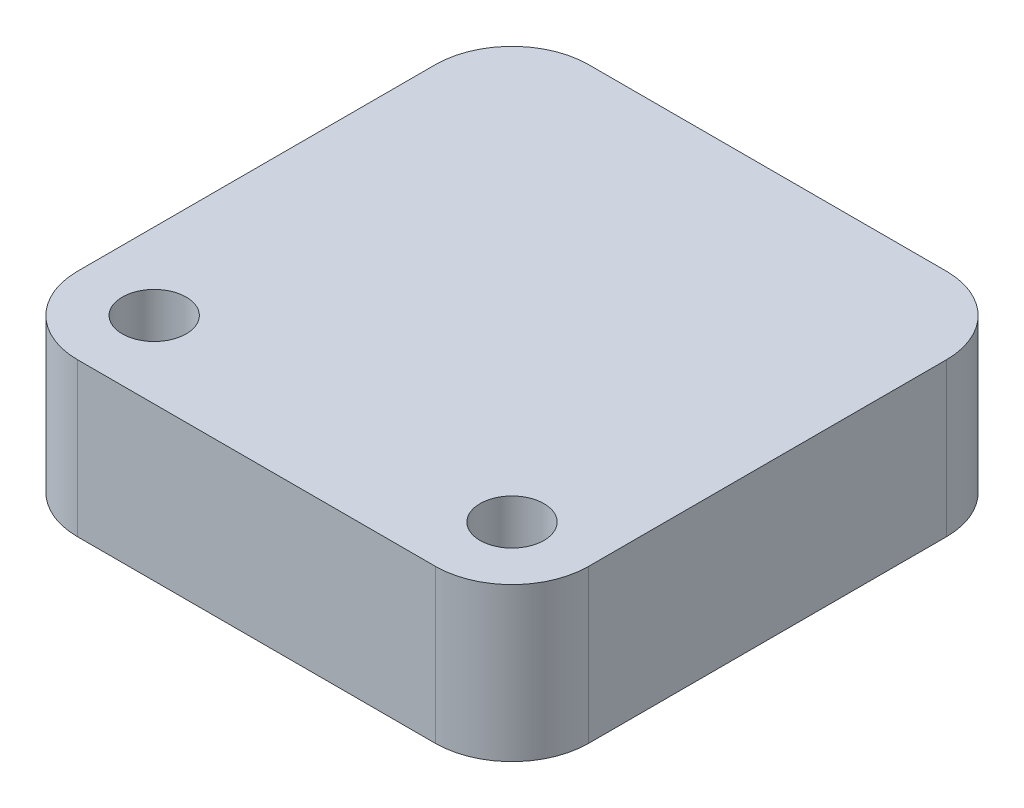
ISO-10303-21;
HEADER;
FILE_DESCRIPTION(('STEP AP214'),'2;1');
FILE_NAME('part.step','',(''),(''),'','','');
FILE_SCHEMA(('AUTOMOTIVE_DESIGN { 1 0 10303 214 1 1 1 1 }'));
ENDSEC;
DATA;
#1=APPLICATION_CONTEXT('core data for automotive mechanical design processes');
#2=APPLICATION_PROTOCOL_DEFINITION('international standard','automotive_design',2000,#1);
#3=PRODUCT_CONTEXT('',#1,'mechanical');
#4=PRODUCT('Part','Part','',(#3));
#5=PRODUCT_RELATED_PRODUCT_CATEGORY('part','',(#4));
#6=PRODUCT_DEFINITION_FORMATION('','',#4);
#7=PRODUCT_DEFINITION_CONTEXT('part definition',#1,'design');
#8=PRODUCT_DEFINITION('design','',#6,#7);
#9=PRODUCT_DEFINITION_SHAPE('','',#8);
#10=(LENGTH_UNIT() NAMED_UNIT(*) SI_UNIT(.MILLI.,.METRE.));
#11=(NAMED_UNIT(*) PLANE_ANGLE_UNIT() SI_UNIT($,.RADIAN.));
#12=(NAMED_UNIT(*) SI_UNIT($,.STERADIAN.) SOLID_ANGLE_UNIT());
#13=UNCERTAINTY_MEASURE_WITH_UNIT(LENGTH_MEASURE(1.E-05),#10,'distance_accuracy_value','');
#14=(GEOMETRIC_REPRESENTATION_CONTEXT(3) GLOBAL_UNCERTAINTY_ASSIGNED_CONTEXT((#13)) GLOBAL_UNIT_ASSIGNED_CONTEXT((#10,
#11,#12)) REPRESENTATION_CONTEXT('',''));
#15=CARTESIAN_POINT('',(0.,0.,0.));
#16=DIRECTION('',(0.,0.,1.));
#17=DIRECTION('',(1.,0.,0.));
#18=AXIS2_PLACEMENT_3D('',#15,#16,#17);
#19=CARTESIAN_POINT('',(0.,6.,0.));
#20=DIRECTION('',(1.,0.,0.));
#21=DIRECTION('',(0.,0.,-1.));
#22=AXIS2_PLACEMENT_3D('',#19,#20,#21);
#23=PLANE('',#22);
#24=DIRECTION('',(0.,0.,1.));
#25=VECTOR('',#24,1.);
#26=CARTESIAN_POINT('',(0.,6.,0.));
#27=LINE('',#26,#25);
#28=CARTESIAN_POINT('',(0.,6.,-17.));
#29=VERTEX_POINT('',#28);
#30=CARTESIAN_POINT('',(0.,6.,-3.));
#31=VERTEX_POINT('',#30);
#32=EDGE_CURVE('E139',#29,#31,#27,.T.);
#33=ORIENTED_EDGE('',*,*,#32,.F.);
#34=DIRECTION('',(0.,-1.,0.));
#35=VECTOR('',#34,1.);
#36=CARTESIAN_POINT('',(0.,6.,-17.));
#37=LINE('',#36,#35);
#38=CARTESIAN_POINT('',(0.,0.,-17.));
#39=VERTEX_POINT('',#38);
#40=EDGE_CURVE('E178',#29,#39,#37,.T.);
#41=ORIENTED_EDGE('',*,*,#40,.T.);
#42=DIRECTION('',(0.,0.,1.));
#43=VECTOR('',#42,1.);
#44=CARTESIAN_POINT('',(0.,0.,0.));
#45=LINE('',#44,#43);
#46=CARTESIAN_POINT('',(0.,0.,-3.));
#47=VERTEX_POINT('',#46);
#48=EDGE_CURVE('E193',#39,#47,#45,.T.);
#49=ORIENTED_EDGE('',*,*,#48,.T.);
#50=DIRECTION('',(0.,-1.,0.));
#51=VECTOR('',#50,1.);
#52=CARTESIAN_POINT('',(0.,6.,-3.));
#53=LINE('',#52,#51);
#54=EDGE_CURVE('E175',#47,#31,#53,.F.);
#55=ORIENTED_EDGE('',*,*,#54,.T.);
#56=EDGE_LOOP('',(#33,#41,#49,#55));
#57=FACE_BOUND('',#56,.T.);
#58=ADVANCED_FACE('F43',(#57),#23,.F.);
#59=CARTESIAN_POINT('',(0.,6.,0.));
#60=DIRECTION('',(0.,0.,-1.));
#61=DIRECTION('',(-1.,0.,0.));
#62=AXIS2_PLACEMENT_3D('',#59,#60,#61);
#63=PLANE('',#62);
#64=DIRECTION('',(1.,0.,0.));
#65=VECTOR('',#64,1.);
#66=CARTESIAN_POINT('',(0.,6.,0.));
#67=LINE('',#66,#65);
#68=CARTESIAN_POINT('',(3.,6.,0.));
#69=VERTEX_POINT('',#68);
#70=CARTESIAN_POINT('',(17.,6.,0.));
#71=VERTEX_POINT('',#70);
#72=EDGE_CURVE('E144',#69,#71,#67,.T.);
#73=ORIENTED_EDGE('',*,*,#72,.F.);
#74=DIRECTION('',(0.,-1.,0.));
#75=VECTOR('',#74,1.);
#76=CARTESIAN_POINT('',(3.,6.,0.));
#77=LINE('',#76,#75);
#78=CARTESIAN_POINT('',(3.,0.,0.));
#79=VERTEX_POINT('',#78);
#80=EDGE_CURVE('E11',#69,#79,#77,.T.);
#81=ORIENTED_EDGE('',*,*,#80,.T.);
#82=DIRECTION('',(1.,0.,0.));
#83=VECTOR('',#82,1.);
#84=CARTESIAN_POINT('',(0.,0.,0.));
#85=LINE('',#84,#83);
#86=CARTESIAN_POINT('',(17.,0.,0.));
#87=VERTEX_POINT('',#86);
#88=EDGE_CURVE('E146',#79,#87,#85,.T.);
#89=ORIENTED_EDGE('',*,*,#88,.T.);
#90=DIRECTION('',(0.,-1.,0.));
#91=VECTOR('',#90,1.);
#92=CARTESIAN_POINT('',(17.,6.,0.));
#93=LINE('',#92,#91);
#94=EDGE_CURVE('E52',#87,#71,#93,.F.);
#95=ORIENTED_EDGE('',*,*,#94,.T.);
#96=EDGE_LOOP('',(#73,#81,#89,#95));
#97=FACE_BOUND('',#96,.T.);
#98=ADVANCED_FACE('F199',(#97),#63,.F.);
#99=CARTESIAN_POINT('',(20.,6.,0.));
#100=DIRECTION('',(-1.,0.,0.));
#101=DIRECTION('',(0.,0.,1.));
#102=AXIS2_PLACEMENT_3D('',#99,#100,#101);
#103=PLANE('',#102);
#104=DIRECTION('',(0.,0.,-1.));
#105=VECTOR('',#104,1.);
#106=CARTESIAN_POINT('',(20.,0.,0.));
#107=LINE('',#106,#105);
#108=CARTESIAN_POINT('',(20.,0.,-3.));
#109=VERTEX_POINT('',#108);
#110=CARTESIAN_POINT('',(20.,0.,-17.));
#111=VERTEX_POINT('',#110);
#112=EDGE_CURVE('E140',#109,#111,#107,.T.);
#113=ORIENTED_EDGE('',*,*,#112,.T.);
#114=DIRECTION('',(0.,-1.,0.));
#115=VECTOR('',#114,1.);
#116=CARTESIAN_POINT('',(20.,6.,-17.));
#117=LINE('',#116,#115);
#118=CARTESIAN_POINT('',(20.,6.,-17.));
#119=VERTEX_POINT('',#118);
#120=EDGE_CURVE('E115',#111,#119,#117,.F.);
#121=ORIENTED_EDGE('',*,*,#120,.T.);
#122=DIRECTION('',(0.,0.,-1.));
#123=VECTOR('',#122,1.);
#124=CARTESIAN_POINT('',(20.,6.,0.));
#125=LINE('',#124,#123);
#126=CARTESIAN_POINT('',(20.,6.,-3.));
#127=VERTEX_POINT('',#126);
#128=EDGE_CURVE('E184',#127,#119,#125,.T.);
#129=ORIENTED_EDGE('',*,*,#128,.F.);
#130=DIRECTION('',(0.,-1.,0.));
#131=VECTOR('',#130,1.);
#132=CARTESIAN_POINT('',(20.,6.,-3.));
#133=LINE('',#132,#131);
#134=EDGE_CURVE('E121',#127,#109,#133,.T.);
#135=ORIENTED_EDGE('',*,*,#134,.T.);
#136=EDGE_LOOP('',(#113,#121,#129,#135));
#137=FACE_BOUND('',#136,.T.);
#138=ADVANCED_FACE('F206',(#137),#103,.F.);
#139=CARTESIAN_POINT('',(0.,6.,-20.));
#140=DIRECTION('',(0.,0.,1.));
#141=DIRECTION('',(1.,0.,0.));
#142=AXIS2_PLACEMENT_3D('',#139,#140,#141);
#143=PLANE('',#142);
#144=DIRECTION('',(-1.,0.,0.));
#145=VECTOR('',#144,1.);
#146=CARTESIAN_POINT('',(0.,6.,-20.));
#147=LINE('',#146,#145);
#148=CARTESIAN_POINT('',(17.,6.,-20.));
#149=VERTEX_POINT('',#148);
#150=CARTESIAN_POINT('',(3.,6.,-20.));
#151=VERTEX_POINT('',#150);
#152=EDGE_CURVE('E131',#149,#151,#147,.T.);
#153=ORIENTED_EDGE('',*,*,#152,.F.);
#154=DIRECTION('',(0.,-1.,0.));
#155=VECTOR('',#154,1.);
#156=CARTESIAN_POINT('',(17.,6.,-20.));
#157=LINE('',#156,#155);
#158=CARTESIAN_POINT('',(17.,0.,-20.));
#159=VERTEX_POINT('',#158);
#160=EDGE_CURVE('E114',#149,#159,#157,.T.);
#161=ORIENTED_EDGE('',*,*,#160,.T.);
#162=DIRECTION('',(-1.,0.,0.));
#163=VECTOR('',#162,1.);
#164=CARTESIAN_POINT('',(0.,0.,-20.));
#165=LINE('',#164,#163);
#166=CARTESIAN_POINT('',(3.,0.,-20.));
#167=VERTEX_POINT('',#166);
#168=EDGE_CURVE('E128',#159,#167,#165,.T.);
#169=ORIENTED_EDGE('',*,*,#168,.T.);
#170=DIRECTION('',(0.,-1.,0.));
#171=VECTOR('',#170,1.);
#172=CARTESIAN_POINT('',(3.,6.,-20.));
#173=LINE('',#172,#171);
#174=EDGE_CURVE('E134',#167,#151,#173,.F.);
#175=ORIENTED_EDGE('',*,*,#174,.T.);
#176=EDGE_LOOP('',(#153,#161,#169,#175));
#177=FACE_BOUND('',#176,.T.);
#178=ADVANCED_FACE('F127',(#177),#143,.F.);
#179=CARTESIAN_POINT('',(0.,6.,0.));
#180=DIRECTION('',(0.,-1.,0.));
#181=DIRECTION('',(0.,0.,-1.));
#182=AXIS2_PLACEMENT_3D('',#179,#180,#181);
#183=PLANE('',#182);
#184=CARTESIAN_POINT('',(3.,6.,-3.));
#185=DIRECTION('',(0.,1.,0.));
#186=DIRECTION('',(0.,0.,1.));
#187=AXIS2_PLACEMENT_3D('',#184,#185,#186);
#188=CIRCLE('',#187,1.25);
#189=CARTESIAN_POINT('',(3.,6.,-1.75));
#190=VERTEX_POINT('',#189);
#191=EDGE_CURVE('E267',#190,#190,#188,.T.);
#192=ORIENTED_EDGE('',*,*,#191,.F.);
#193=EDGE_LOOP('',(#192));
#194=FACE_BOUND('',#193,.T.);
#195=CARTESIAN_POINT('',(17.,6.,-3.));
#196=DIRECTION('',(0.,1.,0.));
#197=DIRECTION('',(0.,0.,1.));
#198=AXIS2_PLACEMENT_3D('',#195,#196,#197);
#199=CIRCLE('',#198,1.25);
#200=CARTESIAN_POINT('',(17.,6.,-1.75));
#201=VERTEX_POINT('',#200);
#202=EDGE_CURVE('E264',#201,#201,#199,.T.);
#203=ORIENTED_EDGE('',*,*,#202,.F.);
#204=EDGE_LOOP('',(#203));
#205=FACE_BOUND('',#204,.T.);
#206=ORIENTED_EDGE('',*,*,#128,.T.);
#207=CARTESIAN_POINT('',(17.,6.,-17.));
#208=DIRECTION('',(0.,-1.,0.));
#209=DIRECTION('',(0.,0.,-1.));
#210=AXIS2_PLACEMENT_3D('',#207,#208,#209);
#211=CIRCLE('',#210,3.);
#212=EDGE_CURVE('E172',#119,#149,#211,.F.);
#213=ORIENTED_EDGE('',*,*,#212,.T.);
#214=ORIENTED_EDGE('',*,*,#152,.T.);
#215=CARTESIAN_POINT('',(3.,6.,-17.));
#216=DIRECTION('',(0.,-1.,0.));
#217=DIRECTION('',(0.,0.,-1.));
#218=AXIS2_PLACEMENT_3D('',#215,#216,#217);
#219=CIRCLE('',#218,3.);
#220=EDGE_CURVE('E169',#151,#29,#219,.F.);
#221=ORIENTED_EDGE('',*,*,#220,.T.);
#222=ORIENTED_EDGE('',*,*,#32,.T.);
#223=CARTESIAN_POINT('',(3.,6.,-3.));
#224=DIRECTION('',(0.,-1.,0.));
#225=DIRECTION('',(0.,0.,-1.));
#226=AXIS2_PLACEMENT_3D('',#223,#224,#225);
#227=CIRCLE('',#226,3.);
#228=EDGE_CURVE('E65',#31,#69,#227,.F.);
#229=ORIENTED_EDGE('',*,*,#228,.T.);
#230=ORIENTED_EDGE('',*,*,#72,.T.);
#231=CARTESIAN_POINT('',(17.,6.,-3.));
#232=DIRECTION('',(0.,-1.,0.));
#233=DIRECTION('',(0.,0.,-1.));
#234=AXIS2_PLACEMENT_3D('',#231,#232,#233);
#235=CIRCLE('',#234,3.);
#236=EDGE_CURVE('E164',#71,#127,#235,.F.);
#237=ORIENTED_EDGE('',*,*,#236,.T.);
#238=EDGE_LOOP('',(#206,#213,#214,#221,#222,#229,#230,#237));
#239=FACE_BOUND('',#238,.T.);
#240=ADVANCED_FACE('F204',(#194,#205,#239),#183,.F.);
#241=CARTESIAN_POINT('',(0.,0.,0.));
#242=DIRECTION('',(0.,-1.,0.));
#243=DIRECTION('',(0.,0.,-1.));
#244=AXIS2_PLACEMENT_3D('',#241,#242,#243);
#245=PLANE('',#244);
#246=CARTESIAN_POINT('',(3.,0.,-3.));
#247=DIRECTION('',(0.,1.,0.));
#248=DIRECTION('',(0.,0.,1.));
#249=AXIS2_PLACEMENT_3D('',#246,#247,#248);
#250=CIRCLE('',#249,1.25);
#251=CARTESIAN_POINT('',(3.,0.,-1.75));
#252=VERTEX_POINT('',#251);
#253=EDGE_CURVE('E196',#252,#252,#250,.T.);
#254=ORIENTED_EDGE('',*,*,#253,.T.);
#255=EDGE_LOOP('',(#254));
#256=FACE_BOUND('',#255,.T.);
#257=CARTESIAN_POINT('',(17.,0.,-3.));
#258=DIRECTION('',(0.,1.,0.));
#259=DIRECTION('',(0.,0.,1.));
#260=AXIS2_PLACEMENT_3D('',#257,#258,#259);
#261=CIRCLE('',#260,1.25);
#262=CARTESIAN_POINT('',(17.,0.,-1.75));
#263=VERTEX_POINT('',#262);
#264=EDGE_CURVE('E262',#263,#263,#261,.T.);
#265=ORIENTED_EDGE('',*,*,#264,.T.);
#266=EDGE_LOOP('',(#265));
#267=FACE_BOUND('',#266,.T.);
#268=ORIENTED_EDGE('',*,*,#168,.F.);
#269=CARTESIAN_POINT('',(17.,0.,-17.));
#270=DIRECTION('',(0.,-1.,0.));
#271=DIRECTION('',(0.,0.,-1.));
#272=AXIS2_PLACEMENT_3D('',#269,#270,#271);
#273=CIRCLE('',#272,3.);
#274=EDGE_CURVE('E110',#159,#111,#273,.T.);
#275=ORIENTED_EDGE('',*,*,#274,.T.);
#276=ORIENTED_EDGE('',*,*,#112,.F.);
#277=CARTESIAN_POINT('',(17.,0.,-3.));
#278=DIRECTION('',(0.,-1.,0.));
#279=DIRECTION('',(0.,0.,-1.));
#280=AXIS2_PLACEMENT_3D('',#277,#278,#279);
#281=CIRCLE('',#280,3.);
#282=EDGE_CURVE('E133',#109,#87,#281,.T.);
#283=ORIENTED_EDGE('',*,*,#282,.T.);
#284=ORIENTED_EDGE('',*,*,#88,.F.);
#285=CARTESIAN_POINT('',(3.,0.,-3.));
#286=DIRECTION('',(0.,-1.,0.));
#287=DIRECTION('',(0.,0.,-1.));
#288=AXIS2_PLACEMENT_3D('',#285,#286,#287);
#289=CIRCLE('',#288,3.);
#290=EDGE_CURVE('E154',#79,#47,#289,.T.);
#291=ORIENTED_EDGE('',*,*,#290,.T.);
#292=ORIENTED_EDGE('',*,*,#48,.F.);
#293=CARTESIAN_POINT('',(3.,0.,-17.));
#294=DIRECTION('',(0.,-1.,0.));
#295=DIRECTION('',(0.,0.,-1.));
#296=AXIS2_PLACEMENT_3D('',#293,#294,#295);
#297=CIRCLE('',#296,3.);
#298=EDGE_CURVE('E122',#39,#167,#297,.T.);
#299=ORIENTED_EDGE('',*,*,#298,.T.);
#300=EDGE_LOOP('',(#268,#275,#276,#283,#284,#291,#292,#299));
#301=FACE_BOUND('',#300,.T.);
#302=ADVANCED_FACE('F136',(#256,#267,#301),#245,.T.);
#303=CARTESIAN_POINT('',(17.,6.,-17.));
#304=DIRECTION('',(0.,-1.,0.));
#305=DIRECTION('',(0.,0.,-1.));
#306=AXIS2_PLACEMENT_3D('',#303,#304,#305);
#307=CYLINDRICAL_SURFACE('',#306,3.);
#308=ORIENTED_EDGE('',*,*,#212,.F.);
#309=ORIENTED_EDGE('',*,*,#120,.F.);
#310=ORIENTED_EDGE('',*,*,#274,.F.);
#311=ORIENTED_EDGE('',*,*,#160,.F.);
#312=EDGE_LOOP('',(#308,#309,#310,#311));
#313=FACE_BOUND('',#312,.T.);
#314=ADVANCED_FACE('F113',(#313),#307,.T.);
#315=CARTESIAN_POINT('',(3.,6.,-17.));
#316=DIRECTION('',(0.,-1.,0.));
#317=DIRECTION('',(0.,0.,-1.));
#318=AXIS2_PLACEMENT_3D('',#315,#316,#317);
#319=CYLINDRICAL_SURFACE('',#318,3.);
#320=ORIENTED_EDGE('',*,*,#220,.F.);
#321=ORIENTED_EDGE('',*,*,#174,.F.);
#322=ORIENTED_EDGE('',*,*,#298,.F.);
#323=ORIENTED_EDGE('',*,*,#40,.F.);
#324=EDGE_LOOP('',(#320,#321,#322,#323));
#325=FACE_BOUND('',#324,.T.);
#326=ADVANCED_FACE('F224',(#325),#319,.T.);
#327=CARTESIAN_POINT('',(3.,6.,-3.));
#328=DIRECTION('',(0.,-1.,0.));
#329=DIRECTION('',(0.,0.,-1.));
#330=AXIS2_PLACEMENT_3D('',#327,#328,#329);
#331=CYLINDRICAL_SURFACE('',#330,3.);
#332=ORIENTED_EDGE('',*,*,#228,.F.);
#333=ORIENTED_EDGE('',*,*,#54,.F.);
#334=ORIENTED_EDGE('',*,*,#290,.F.);
#335=ORIENTED_EDGE('',*,*,#80,.F.);
#336=EDGE_LOOP('',(#332,#333,#334,#335));
#337=FACE_BOUND('',#336,.T.);
#338=ADVANCED_FACE('F226',(#337),#331,.T.);
#339=CARTESIAN_POINT('',(17.,6.,-3.));
#340=DIRECTION('',(0.,-1.,0.));
#341=DIRECTION('',(0.,0.,-1.));
#342=AXIS2_PLACEMENT_3D('',#339,#340,#341);
#343=CYLINDRICAL_SURFACE('',#342,3.);
#344=ORIENTED_EDGE('',*,*,#236,.F.);
#345=ORIENTED_EDGE('',*,*,#94,.F.);
#346=ORIENTED_EDGE('',*,*,#282,.F.);
#347=ORIENTED_EDGE('',*,*,#134,.F.);
#348=EDGE_LOOP('',(#344,#345,#346,#347));
#349=FACE_BOUND('',#348,.T.);
#350=ADVANCED_FACE('F45',(#349),#343,.T.);
#351=CARTESIAN_POINT('',(17.,0.,-3.));
#352=DIRECTION('',(0.,1.,0.));
#353=DIRECTION('',(0.,0.,1.));
#354=AXIS2_PLACEMENT_3D('',#351,#352,#353);
#355=CYLINDRICAL_SURFACE('',#354,1.25);
#356=ORIENTED_EDGE('',*,*,#264,.F.);
#357=EDGE_LOOP('',(#356));
#358=FACE_BOUND('',#357,.T.);
#359=ORIENTED_EDGE('',*,*,#202,.T.);
#360=EDGE_LOOP('',(#359));
#361=FACE_BOUND('',#360,.T.);
#362=ADVANCED_FACE('F233',(#358,#361),#355,.F.);
#363=CARTESIAN_POINT('',(3.,0.,-3.));
#364=DIRECTION('',(0.,1.,0.));
#365=DIRECTION('',(0.,0.,1.));
#366=AXIS2_PLACEMENT_3D('',#363,#364,#365);
#367=CYLINDRICAL_SURFACE('',#366,1.25);
#368=ORIENTED_EDGE('',*,*,#253,.F.);
#369=EDGE_LOOP('',(#368));
#370=FACE_BOUND('',#369,.T.);
#371=ORIENTED_EDGE('',*,*,#191,.T.);
#372=EDGE_LOOP('',(#371));
#373=FACE_BOUND('',#372,.T.);
#374=ADVANCED_FACE('F240',(#370,#373),#367,.F.);
#375=CLOSED_SHELL('',(#58,#98,#138,#178,#240,#302,#314,#326,#338,#350,#362,#374));
#376=MANIFOLD_SOLID_BREP('B2',#375);
#377=ADVANCED_BREP_SHAPE_REPRESENTATION('',(#18,#376),#14);
#378=SHAPE_DEFINITION_REPRESENTATION(#9,#377);
ENDSEC;
END-ISO-10303-21;
